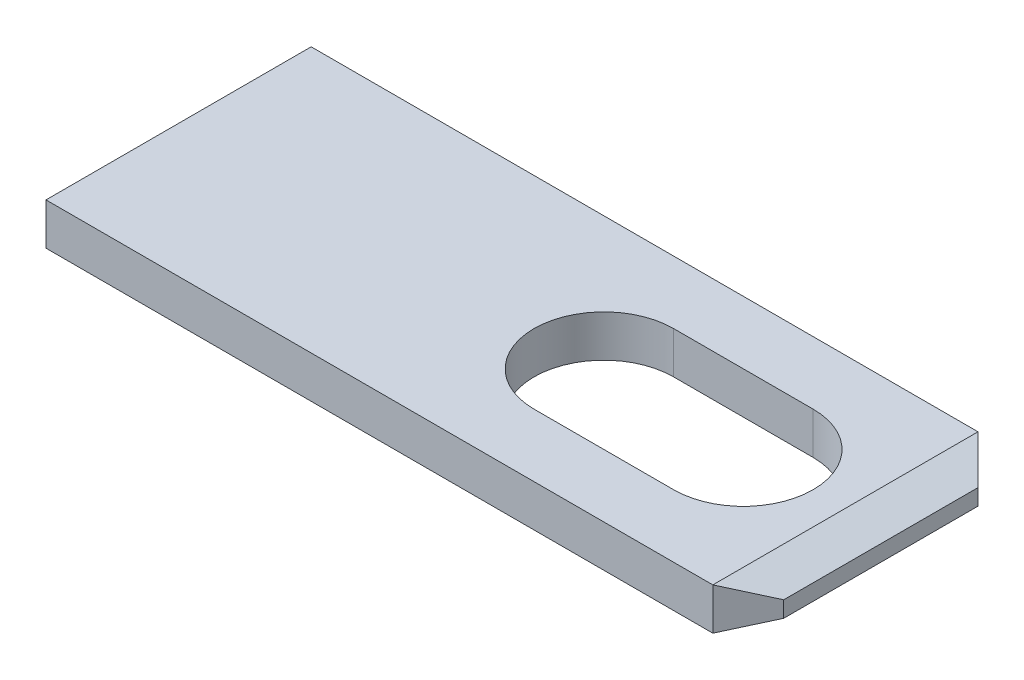
ISO-10303-21;
HEADER;
FILE_DESCRIPTION(('STEP AP214'),'2;1');
FILE_NAME('part.step','',(''),(''),'','','');
FILE_SCHEMA(('AUTOMOTIVE_DESIGN { 1 0 10303 214 1 1 1 1 }'));
ENDSEC;
DATA;
#1=APPLICATION_CONTEXT('core data for automotive mechanical design processes');
#2=APPLICATION_PROTOCOL_DEFINITION('international standard','automotive_design',2000,#1);
#3=PRODUCT_CONTEXT('',#1,'mechanical');
#4=PRODUCT('Part','Part','',(#3));
#5=PRODUCT_RELATED_PRODUCT_CATEGORY('part','',(#4));
#6=PRODUCT_DEFINITION_FORMATION('','',#4);
#7=PRODUCT_DEFINITION_CONTEXT('part definition',#1,'design');
#8=PRODUCT_DEFINITION('design','',#6,#7);
#9=PRODUCT_DEFINITION_SHAPE('','',#8);
#10=(LENGTH_UNIT() NAMED_UNIT(*) SI_UNIT(.MILLI.,.METRE.));
#11=(NAMED_UNIT(*) PLANE_ANGLE_UNIT() SI_UNIT($,.RADIAN.));
#12=(NAMED_UNIT(*) SI_UNIT($,.STERADIAN.) SOLID_ANGLE_UNIT());
#13=UNCERTAINTY_MEASURE_WITH_UNIT(LENGTH_MEASURE(1.E-05),#10,'distance_accuracy_value','');
#14=(GEOMETRIC_REPRESENTATION_CONTEXT(3) GLOBAL_UNCERTAINTY_ASSIGNED_CONTEXT((#13)) GLOBAL_UNIT_ASSIGNED_CONTEXT((#10,
#11,#12)) REPRESENTATION_CONTEXT('',''));
#15=CARTESIAN_POINT('',(0.,0.,0.));
#16=DIRECTION('',(0.,0.,1.));
#17=DIRECTION('',(1.,0.,0.));
#18=AXIS2_PLACEMENT_3D('',#15,#16,#17);
#19=CARTESIAN_POINT('',(10.063988,-0.115103120992769,1.89999999999998));
#20=DIRECTION('',(0.342020143325666,-0.939692620785909,0.));
#21=DIRECTION('',(0.939692620785909,0.342020143325666,0.));
#22=AXIS2_PLACEMENT_3D('',#19,#20,#21);
#23=PLANE('',#22);
#24=DIRECTION('',(-0.684791078771737,-0.249243569363954,-0.684791078771735));
#25=VECTOR('',#24,1.);
#26=CARTESIAN_POINT('',(10.063988,-0.115103120992769,-1.39200000000001));
#27=LINE('',#26,#25);
#28=CARTESIAN_POINT('',(10.063988,-0.115103120992769,-1.39200000000001));
#29=VERTEX_POINT('',#28);
#30=CARTESIAN_POINT('',(9.555988,-0.299999999999999,-1.90000000000001));
#31=VERTEX_POINT('',#30);
#32=EDGE_CURVE('E119',#29,#31,#27,.T.);
#33=ORIENTED_EDGE('',*,*,#32,.F.);
#34=DIRECTION('',(0.,0.,-1.));
#35=VECTOR('',#34,1.);
#36=CARTESIAN_POINT('',(10.063988,-0.115103120992769,1.89999999999998));
#37=LINE('',#36,#35);
#38=CARTESIAN_POINT('',(10.063988,-0.115103120992769,1.39199999999999));
#39=VERTEX_POINT('',#38);
#40=EDGE_CURVE('E143',#39,#29,#37,.T.);
#41=ORIENTED_EDGE('',*,*,#40,.F.);
#42=DIRECTION('',(0.684791078771737,0.249243569363954,-0.684791078771735));
#43=VECTOR('',#42,1.);
#44=CARTESIAN_POINT('',(9.555988,-0.3,1.89999999999999));
#45=LINE('',#44,#43);
#46=CARTESIAN_POINT('',(9.555988,-0.3,1.89999999999999));
#47=VERTEX_POINT('',#46);
#48=EDGE_CURVE('E140',#47,#39,#45,.T.);
#49=ORIENTED_EDGE('',*,*,#48,.F.);
#50=DIRECTION('',(0.,0.,1.));
#51=VECTOR('',#50,1.);
#52=CARTESIAN_POINT('',(9.555988,-0.3,-1.90000000000001));
#53=LINE('',#52,#51);
#54=EDGE_CURVE('E101',#47,#31,#53,.F.);
#55=ORIENTED_EDGE('',*,*,#54,.T.);
#56=EDGE_LOOP('',(#33,#41,#49,#55));
#57=FACE_BOUND('',#56,.T.);
#58=ADVANCED_FACE('F17',(#57),#23,.T.);
#59=CARTESIAN_POINT('',(10.063988,0.299999999999999,-1.39200000000001));
#60=DIRECTION('',(0.707106781186546,0.,-0.707106781186549));
#61=DIRECTION('',(-0.707106781186549,0.,-0.707106781186546));
#62=AXIS2_PLACEMENT_3D('',#59,#60,#61);
#63=PLANE('',#62);
#64=DIRECTION('',(0.,1.,0.));
#65=VECTOR('',#64,1.);
#66=CARTESIAN_POINT('',(9.555988,-0.3,-1.90000000000001));
#67=LINE('',#66,#65);
#68=CARTESIAN_POINT('',(9.555988,0.3,-1.90000000000001));
#69=VERTEX_POINT('',#68);
#70=EDGE_CURVE('E154',#31,#69,#67,.T.);
#71=ORIENTED_EDGE('',*,*,#70,.T.);
#72=DIRECTION('',(-0.684791078771737,0.249243569363953,-0.684791078771735));
#73=VECTOR('',#72,1.);
#74=CARTESIAN_POINT('',(10.063988,0.115103120992769,-1.39200000000001));
#75=LINE('',#74,#73);
#76=CARTESIAN_POINT('',(10.063988,0.115103120992769,-1.39200000000001));
#77=VERTEX_POINT('',#76);
#78=EDGE_CURVE('E169',#77,#69,#75,.T.);
#79=ORIENTED_EDGE('',*,*,#78,.F.);
#80=DIRECTION('',(0.,1.,0.));
#81=VECTOR('',#80,1.);
#82=CARTESIAN_POINT('',(10.063988,0.299999999999999,-1.39200000000001));
#83=LINE('',#82,#81);
#84=EDGE_CURVE('E142',#29,#77,#83,.T.);
#85=ORIENTED_EDGE('',*,*,#84,.F.);
#86=ORIENTED_EDGE('',*,*,#32,.T.);
#87=EDGE_LOOP('',(#71,#79,#85,#86));
#88=FACE_BOUND('',#87,.T.);
#89=ADVANCED_FACE('F151',(#88),#63,.T.);
#90=CARTESIAN_POINT('',(10.063988,0.299999999999999,1.89999999999998));
#91=DIRECTION('',(1.,0.,0.));
#92=DIRECTION('',(0.,0.,-1.));
#93=AXIS2_PLACEMENT_3D('',#90,#91,#92);
#94=PLANE('',#93);
#95=ORIENTED_EDGE('',*,*,#84,.T.);
#96=DIRECTION('',(0.,0.,1.));
#97=VECTOR('',#96,1.);
#98=CARTESIAN_POINT('',(10.063988,0.115103120992768,1.89999999999998));
#99=LINE('',#98,#97);
#100=CARTESIAN_POINT('',(10.063988,0.115103120992769,1.39199999999999));
#101=VERTEX_POINT('',#100);
#102=EDGE_CURVE('E180',#101,#77,#99,.F.);
#103=ORIENTED_EDGE('',*,*,#102,.F.);
#104=DIRECTION('',(0.,1.,0.));
#105=VECTOR('',#104,1.);
#106=CARTESIAN_POINT('',(10.063988,0.299999999999999,1.39199999999999));
#107=LINE('',#106,#105);
#108=EDGE_CURVE('E138',#39,#101,#107,.T.);
#109=ORIENTED_EDGE('',*,*,#108,.F.);
#110=ORIENTED_EDGE('',*,*,#40,.T.);
#111=EDGE_LOOP('',(#95,#103,#109,#110));
#112=FACE_BOUND('',#111,.T.);
#113=ADVANCED_FACE('F299',(#112),#94,.T.);
#114=CARTESIAN_POINT('',(10.063988,0.299999999999999,1.39199999999999));
#115=DIRECTION('',(0.707106781186546,0.,0.707106781186549));
#116=DIRECTION('',(0.707106781186549,0.,-0.707106781186546));
#117=AXIS2_PLACEMENT_3D('',#114,#115,#116);
#118=PLANE('',#117);
#119=ORIENTED_EDGE('',*,*,#108,.T.);
#120=DIRECTION('',(0.684791078771738,-0.249243569363953,-0.684791078771735));
#121=VECTOR('',#120,1.);
#122=CARTESIAN_POINT('',(9.555988,0.299999999999998,1.89999999999998));
#123=LINE('',#122,#121);
#124=CARTESIAN_POINT('',(9.555988,0.299999999999999,1.89999999999999));
#125=VERTEX_POINT('',#124);
#126=EDGE_CURVE('E177',#125,#101,#123,.T.);
#127=ORIENTED_EDGE('',*,*,#126,.F.);
#128=DIRECTION('',(0.,1.,0.));
#129=VECTOR('',#128,1.);
#130=CARTESIAN_POINT('',(9.555988,-0.3,1.89999999999998));
#131=LINE('',#130,#129);
#132=EDGE_CURVE('E34',#125,#47,#131,.F.);
#133=ORIENTED_EDGE('',*,*,#132,.T.);
#134=ORIENTED_EDGE('',*,*,#48,.T.);
#135=EDGE_LOOP('',(#119,#127,#133,#134));
#136=FACE_BOUND('',#135,.T.);
#137=ADVANCED_FACE('F291',(#136),#118,.T.);
#138=CARTESIAN_POINT('',(10.063988,-0.3,-1.90000000000001));
#139=DIRECTION('',(0.,1.,0.));
#140=DIRECTION('',(0.,0.,1.));
#141=AXIS2_PLACEMENT_3D('',#138,#139,#140);
#142=PLANE('',#141);
#143=ORIENTED_EDGE('',*,*,#54,.F.);
#144=DIRECTION('',(-1.,0.,0.));
#145=VECTOR('',#144,1.);
#146=CARTESIAN_POINT('',(10.063988,-0.3,1.89999999999998));
#147=LINE('',#146,#145);
#148=CARTESIAN_POINT('',(0.,-0.3,1.89999999999999));
#149=VERTEX_POINT('',#148);
#150=EDGE_CURVE('E129',#47,#149,#147,.T.);
#151=ORIENTED_EDGE('',*,*,#150,.T.);
#152=DIRECTION('',(0.,0.,-1.));
#153=VECTOR('',#152,1.);
#154=CARTESIAN_POINT('',(0.,-0.3,1.89999999999998));
#155=LINE('',#154,#153);
#156=CARTESIAN_POINT('',(0.,-0.3,-1.90000000000001));
#157=VERTEX_POINT('',#156);
#158=EDGE_CURVE('E109',#149,#157,#155,.T.);
#159=ORIENTED_EDGE('',*,*,#158,.T.);
#160=DIRECTION('',(1.,0.,0.));
#161=VECTOR('',#160,1.);
#162=CARTESIAN_POINT('',(10.063988,-0.3,-1.90000000000001));
#163=LINE('',#162,#161);
#164=EDGE_CURVE('E165',#157,#31,#163,.T.);
#165=ORIENTED_EDGE('',*,*,#164,.T.);
#166=EDGE_LOOP('',(#143,#151,#159,#165));
#167=FACE_BOUND('',#166,.T.);
#168=CARTESIAN_POINT('',(6.09373158605447,-0.300000000000001,0.));
#169=DIRECTION('',(0.,1.,0.));
#170=DIRECTION('',(0.,0.,1.));
#171=AXIS2_PLACEMENT_3D('',#168,#169,#170);
#172=CIRCLE('',#171,1.);
#173=CARTESIAN_POINT('',(6.09373158605447,-0.300000000000001,-1.));
#174=VERTEX_POINT('',#173);
#175=CARTESIAN_POINT('',(6.09373158605447,-0.300000000000001,1.));
#176=VERTEX_POINT('',#175);
#177=EDGE_CURVE('E113',#174,#176,#172,.T.);
#178=ORIENTED_EDGE('',*,*,#177,.T.);
#179=DIRECTION('',(1.,0.,0.));
#180=VECTOR('',#179,1.);
#181=CARTESIAN_POINT('',(8.09373158605447,-0.300000000000001,1.));
#182=LINE('',#181,#180);
#183=CARTESIAN_POINT('',(8.09373158605447,-0.300000000000001,1.));
#184=VERTEX_POINT('',#183);
#185=EDGE_CURVE('E105',#176,#184,#182,.T.);
#186=ORIENTED_EDGE('',*,*,#185,.T.);
#187=CARTESIAN_POINT('',(8.09373158605447,-0.3,0.));
#188=DIRECTION('',(0.,1.,0.));
#189=DIRECTION('',(0.,0.,1.));
#190=AXIS2_PLACEMENT_3D('',#187,#188,#189);
#191=CIRCLE('',#190,1.);
#192=CARTESIAN_POINT('',(8.09373158605447,-0.3,-1.));
#193=VERTEX_POINT('',#192);
#194=EDGE_CURVE('E20',#184,#193,#191,.T.);
#195=ORIENTED_EDGE('',*,*,#194,.T.);
#196=DIRECTION('',(1.,0.,0.));
#197=VECTOR('',#196,1.);
#198=CARTESIAN_POINT('',(6.09373158605447,-0.300000000000001,-1.));
#199=LINE('',#198,#197);
#200=EDGE_CURVE('E121',#193,#174,#199,.F.);
#201=ORIENTED_EDGE('',*,*,#200,.T.);
#202=EDGE_LOOP('',(#178,#186,#195,#201));
#203=FACE_BOUND('',#202,.T.);
#204=ADVANCED_FACE('F111',(#167,#203),#142,.F.);
#205=CARTESIAN_POINT('',(8.09373158605447,-0.300000000000001,0.));
#206=DIRECTION('',(0.,1.,0.));
#207=DIRECTION('',(0.,0.,1.));
#208=AXIS2_PLACEMENT_3D('',#205,#206,#207);
#209=CYLINDRICAL_SURFACE('',#208,1.);
#210=DIRECTION('',(0.,1.,0.));
#211=VECTOR('',#210,1.);
#212=CARTESIAN_POINT('',(8.09373158605447,-0.300000000000001,-1.));
#213=LINE('',#212,#211);
#214=CARTESIAN_POINT('',(8.09373158605447,0.3,-1.));
#215=VERTEX_POINT('',#214);
#216=EDGE_CURVE('E97',#215,#193,#213,.F.);
#217=ORIENTED_EDGE('',*,*,#216,.T.);
#218=ORIENTED_EDGE('',*,*,#194,.F.);
#219=DIRECTION('',(0.,-1.,0.));
#220=VECTOR('',#219,1.);
#221=CARTESIAN_POINT('',(8.09373158605447,-0.300000000000001,1.));
#222=LINE('',#221,#220);
#223=CARTESIAN_POINT('',(8.09373158605447,0.3,1.));
#224=VERTEX_POINT('',#223);
#225=EDGE_CURVE('E95',#184,#224,#222,.F.);
#226=ORIENTED_EDGE('',*,*,#225,.T.);
#227=CARTESIAN_POINT('',(8.09373158605447,0.3,0.));
#228=DIRECTION('',(0.,1.,0.));
#229=DIRECTION('',(0.,0.,1.));
#230=AXIS2_PLACEMENT_3D('',#227,#228,#229);
#231=CIRCLE('',#230,1.);
#232=EDGE_CURVE('E128',#224,#215,#231,.T.);
#233=ORIENTED_EDGE('',*,*,#232,.T.);
#234=EDGE_LOOP('',(#217,#218,#226,#233));
#235=FACE_BOUND('',#234,.T.);
#236=ADVANCED_FACE('F93',(#235),#209,.F.);
#237=CARTESIAN_POINT('',(6.09373158605447,-0.300000000000001,-1.));
#238=DIRECTION('',(0.,0.,-1.));
#239=DIRECTION('',(0.,1.,0.));
#240=AXIS2_PLACEMENT_3D('',#237,#238,#239);
#241=PLANE('',#240);
#242=DIRECTION('',(0.,1.,0.));
#243=VECTOR('',#242,1.);
#244=CARTESIAN_POINT('',(6.09373158605447,-0.300000000000001,-1.));
#245=LINE('',#244,#243);
#246=CARTESIAN_POINT('',(6.09373158605447,0.3,-1.));
#247=VERTEX_POINT('',#246);
#248=EDGE_CURVE('E123',#247,#174,#245,.F.);
#249=ORIENTED_EDGE('',*,*,#248,.T.);
#250=ORIENTED_EDGE('',*,*,#200,.F.);
#251=ORIENTED_EDGE('',*,*,#216,.F.);
#252=DIRECTION('',(1.,0.,0.));
#253=VECTOR('',#252,1.);
#254=CARTESIAN_POINT('',(10.063988,0.3,-1.));
#255=LINE('',#254,#253);
#256=EDGE_CURVE('E127',#215,#247,#255,.F.);
#257=ORIENTED_EDGE('',*,*,#256,.T.);
#258=EDGE_LOOP('',(#249,#250,#251,#257));
#259=FACE_BOUND('',#258,.T.);
#260=ADVANCED_FACE('F268',(#259),#241,.F.);
#261=CARTESIAN_POINT('',(6.09373158605447,-0.300000000000001,0.));
#262=DIRECTION('',(0.,1.,0.));
#263=DIRECTION('',(0.,0.,1.));
#264=AXIS2_PLACEMENT_3D('',#261,#262,#263);
#265=CYLINDRICAL_SURFACE('',#264,1.);
#266=DIRECTION('',(0.,-1.,0.));
#267=VECTOR('',#266,1.);
#268=CARTESIAN_POINT('',(6.09373158605447,-0.300000000000001,1.));
#269=LINE('',#268,#267);
#270=CARTESIAN_POINT('',(6.09373158605447,0.3,1.));
#271=VERTEX_POINT('',#270);
#272=EDGE_CURVE('E114',#271,#176,#269,.T.);
#273=ORIENTED_EDGE('',*,*,#272,.T.);
#274=ORIENTED_EDGE('',*,*,#177,.F.);
#275=ORIENTED_EDGE('',*,*,#248,.F.);
#276=CARTESIAN_POINT('',(6.09373158605447,0.3,0.));
#277=DIRECTION('',(0.,1.,0.));
#278=DIRECTION('',(0.,0.,1.));
#279=AXIS2_PLACEMENT_3D('',#276,#277,#278);
#280=CIRCLE('',#279,1.);
#281=EDGE_CURVE('E124',#247,#271,#280,.T.);
#282=ORIENTED_EDGE('',*,*,#281,.T.);
#283=EDGE_LOOP('',(#273,#274,#275,#282));
#284=FACE_BOUND('',#283,.T.);
#285=ADVANCED_FACE('F214',(#284),#265,.F.);
#286=CARTESIAN_POINT('',(8.09373158605447,-0.300000000000001,1.));
#287=DIRECTION('',(0.,0.,1.));
#288=DIRECTION('',(0.,-1.,0.));
#289=AXIS2_PLACEMENT_3D('',#286,#287,#288);
#290=PLANE('',#289);
#291=ORIENTED_EDGE('',*,*,#225,.F.);
#292=ORIENTED_EDGE('',*,*,#185,.F.);
#293=ORIENTED_EDGE('',*,*,#272,.F.);
#294=DIRECTION('',(1.,0.,0.));
#295=VECTOR('',#294,1.);
#296=CARTESIAN_POINT('',(10.063988,0.3,1.));
#297=LINE('',#296,#295);
#298=EDGE_CURVE('E108',#271,#224,#297,.T.);
#299=ORIENTED_EDGE('',*,*,#298,.T.);
#300=EDGE_LOOP('',(#291,#292,#293,#299));
#301=FACE_BOUND('',#300,.T.);
#302=ADVANCED_FACE('F104',(#301),#290,.F.);
#303=CARTESIAN_POINT('',(0.,0.299999999999999,1.89999999999998));
#304=DIRECTION('',(1.,0.,0.));
#305=DIRECTION('',(0.,0.,-1.));
#306=AXIS2_PLACEMENT_3D('',#303,#304,#305);
#307=PLANE('',#306);
#308=DIRECTION('',(0.,0.,-1.));
#309=VECTOR('',#308,1.);
#310=CARTESIAN_POINT('',(0.,0.3,-1.90000000000001));
#311=LINE('',#310,#309);
#312=CARTESIAN_POINT('',(0.,0.3,1.89999999999999));
#313=VERTEX_POINT('',#312);
#314=CARTESIAN_POINT('',(0.,0.3,-1.90000000000001));
#315=VERTEX_POINT('',#314);
#316=EDGE_CURVE('E190',#313,#315,#311,.T.);
#317=ORIENTED_EDGE('',*,*,#316,.T.);
#318=DIRECTION('',(0.,1.,0.));
#319=VECTOR('',#318,1.);
#320=CARTESIAN_POINT('',(0.,-0.3,-1.90000000000001));
#321=LINE('',#320,#319);
#322=EDGE_CURVE('E171',#315,#157,#321,.F.);
#323=ORIENTED_EDGE('',*,*,#322,.T.);
#324=ORIENTED_EDGE('',*,*,#158,.F.);
#325=DIRECTION('',(0.,1.,0.));
#326=VECTOR('',#325,1.);
#327=CARTESIAN_POINT('',(0.,-0.3,1.89999999999998));
#328=LINE('',#327,#326);
#329=EDGE_CURVE('E183',#149,#313,#328,.T.);
#330=ORIENTED_EDGE('',*,*,#329,.T.);
#331=EDGE_LOOP('',(#317,#323,#324,#330));
#332=FACE_BOUND('',#331,.T.);
#333=ADVANCED_FACE('F205',(#332),#307,.F.);
#334=CARTESIAN_POINT('',(10.063988,-0.3,-1.90000000000001));
#335=DIRECTION('',(0.,0.,1.));
#336=DIRECTION('',(1.,0.,0.));
#337=AXIS2_PLACEMENT_3D('',#334,#335,#336);
#338=PLANE('',#337);
#339=ORIENTED_EDGE('',*,*,#70,.F.);
#340=ORIENTED_EDGE('',*,*,#164,.F.);
#341=ORIENTED_EDGE('',*,*,#322,.F.);
#342=DIRECTION('',(1.,0.,0.));
#343=VECTOR('',#342,1.);
#344=CARTESIAN_POINT('',(10.063988,0.3,-1.90000000000001));
#345=LINE('',#344,#343);
#346=EDGE_CURVE('E168',#315,#69,#345,.T.);
#347=ORIENTED_EDGE('',*,*,#346,.T.);
#348=EDGE_LOOP('',(#339,#340,#341,#347));
#349=FACE_BOUND('',#348,.T.);
#350=ADVANCED_FACE('F164',(#349),#338,.F.);
#351=CARTESIAN_POINT('',(10.063988,0.115103120992768,1.89999999999998));
#352=DIRECTION('',(0.342020143325666,0.939692620785909,0.));
#353=DIRECTION('',(-0.939692620785909,0.342020143325666,0.));
#354=AXIS2_PLACEMENT_3D('',#351,#352,#353);
#355=PLANE('',#354);
#356=ORIENTED_EDGE('',*,*,#126,.T.);
#357=ORIENTED_EDGE('',*,*,#102,.T.);
#358=ORIENTED_EDGE('',*,*,#78,.T.);
#359=DIRECTION('',(0.,0.,-1.));
#360=VECTOR('',#359,1.);
#361=CARTESIAN_POINT('',(9.555988,0.3,-1.90000000000001));
#362=LINE('',#361,#360);
#363=EDGE_CURVE('E26',#69,#125,#362,.F.);
#364=ORIENTED_EDGE('',*,*,#363,.T.);
#365=EDGE_LOOP('',(#356,#357,#358,#364));
#366=FACE_BOUND('',#365,.T.);
#367=ADVANCED_FACE('F196',(#366),#355,.T.);
#368=CARTESIAN_POINT('',(10.063988,-0.3,1.89999999999998));
#369=DIRECTION('',(0.,0.,-1.));
#370=DIRECTION('',(-1.,0.,0.));
#371=AXIS2_PLACEMENT_3D('',#368,#369,#370);
#372=PLANE('',#371);
#373=ORIENTED_EDGE('',*,*,#132,.F.);
#374=DIRECTION('',(1.,0.,0.));
#375=VECTOR('',#374,1.);
#376=CARTESIAN_POINT('',(10.063988,0.299999999999999,1.89999999999999));
#377=LINE('',#376,#375);
#378=EDGE_CURVE('E11',#125,#313,#377,.F.);
#379=ORIENTED_EDGE('',*,*,#378,.T.);
#380=ORIENTED_EDGE('',*,*,#329,.F.);
#381=ORIENTED_EDGE('',*,*,#150,.F.);
#382=EDGE_LOOP('',(#373,#379,#380,#381));
#383=FACE_BOUND('',#382,.T.);
#384=ADVANCED_FACE('F203',(#383),#372,.F.);
#385=CARTESIAN_POINT('',(10.063988,0.3,-1.90000000000001));
#386=DIRECTION('',(0.,-1.,0.));
#387=DIRECTION('',(0.,0.,-1.));
#388=AXIS2_PLACEMENT_3D('',#385,#386,#387);
#389=PLANE('',#388);
#390=ORIENTED_EDGE('',*,*,#363,.F.);
#391=ORIENTED_EDGE('',*,*,#346,.F.);
#392=ORIENTED_EDGE('',*,*,#316,.F.);
#393=ORIENTED_EDGE('',*,*,#378,.F.);
#394=EDGE_LOOP('',(#390,#391,#392,#393));
#395=FACE_BOUND('',#394,.T.);
#396=ORIENTED_EDGE('',*,*,#281,.F.);
#397=ORIENTED_EDGE('',*,*,#256,.F.);
#398=ORIENTED_EDGE('',*,*,#232,.F.);
#399=ORIENTED_EDGE('',*,*,#298,.F.);
#400=EDGE_LOOP('',(#396,#397,#398,#399));
#401=FACE_BOUND('',#400,.T.);
#402=ADVANCED_FACE('F200',(#395,#401),#389,.F.);
#403=CLOSED_SHELL('',(#58,#89,#113,#137,#204,#236,#260,#285,#302,#333,#350,#367,#384,#402));
#404=MANIFOLD_SOLID_BREP('B1',#403);
#405=ADVANCED_BREP_SHAPE_REPRESENTATION('',(#18,#404),#14);
#406=SHAPE_DEFINITION_REPRESENTATION(#9,#405);
ENDSEC;
END-ISO-10303-21;
